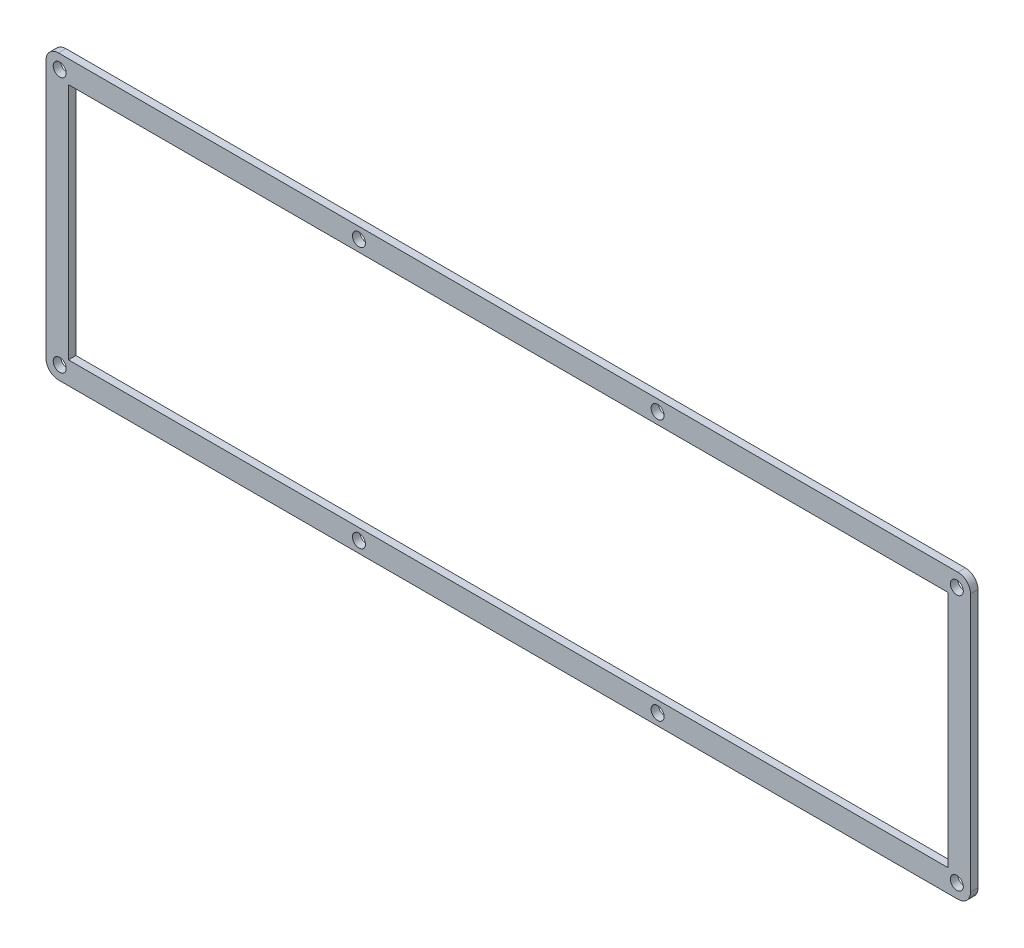
ISO-10303-21;
HEADER;
FILE_DESCRIPTION(('STEP AP214'),'2;1');
FILE_NAME('part.step','',(''),(''),'','','');
FILE_SCHEMA(('AUTOMOTIVE_DESIGN { 1 0 10303 214 1 1 1 1 }'));
ENDSEC;
DATA;
#1=APPLICATION_CONTEXT('core data for automotive mechanical design processes');
#2=APPLICATION_PROTOCOL_DEFINITION('international standard','automotive_design',2000,#1);
#3=PRODUCT_CONTEXT('',#1,'mechanical');
#4=PRODUCT('Part','Part','',(#3));
#5=PRODUCT_RELATED_PRODUCT_CATEGORY('part','',(#4));
#6=PRODUCT_DEFINITION_FORMATION('','',#4);
#7=PRODUCT_DEFINITION_CONTEXT('part definition',#1,'design');
#8=PRODUCT_DEFINITION('design','',#6,#7);
#9=PRODUCT_DEFINITION_SHAPE('','',#8);
#10=(LENGTH_UNIT() NAMED_UNIT(*) SI_UNIT(.MILLI.,.METRE.));
#11=(NAMED_UNIT(*) PLANE_ANGLE_UNIT() SI_UNIT($,.RADIAN.));
#12=(NAMED_UNIT(*) SI_UNIT($,.STERADIAN.) SOLID_ANGLE_UNIT());
#13=UNCERTAINTY_MEASURE_WITH_UNIT(LENGTH_MEASURE(1.E-05),#10,'distance_accuracy_value','');
#14=(GEOMETRIC_REPRESENTATION_CONTEXT(3) GLOBAL_UNCERTAINTY_ASSIGNED_CONTEXT((#13)) GLOBAL_UNIT_ASSIGNED_CONTEXT((#10,
#11,#12)) REPRESENTATION_CONTEXT('',''));
#15=CARTESIAN_POINT('',(0.,0.,0.));
#16=DIRECTION('',(0.,0.,1.));
#17=DIRECTION('',(1.,0.,0.));
#18=AXIS2_PLACEMENT_3D('',#15,#16,#17);
#19=CARTESIAN_POINT('',(365.774999999987,5.,3.));
#20=DIRECTION('',(0.,0.,1.));
#21=DIRECTION('',(1.,0.,0.));
#22=AXIS2_PLACEMENT_3D('',#19,#20,#21);
#23=PLANE('',#22);
#24=CARTESIAN_POINT('',(125.5,109.099999999986,3.));
#25=DIRECTION('',(0.,0.,1.));
#26=DIRECTION('',(1.,0.,0.));
#27=AXIS2_PLACEMENT_3D('',#24,#25,#26);
#28=CIRCLE('',#27,2.59999999999999);
#29=CARTESIAN_POINT('',(128.1,109.099999999986,3.));
#30=VERTEX_POINT('',#29);
#31=EDGE_CURVE('E163',#30,#30,#28,.T.);
#32=ORIENTED_EDGE('',*,*,#31,.F.);
#33=EDGE_LOOP('',(#32));
#34=FACE_BOUND('',#33,.T.);
#35=CARTESIAN_POINT('',(125.5,4.4999999999994,3.));
#36=DIRECTION('',(0.,0.,1.));
#37=DIRECTION('',(1.,0.,0.));
#38=AXIS2_PLACEMENT_3D('',#35,#36,#37);
#39=CIRCLE('',#38,2.59999999999999);
#40=CARTESIAN_POINT('',(128.1,4.4999999999994,3.));
#41=VERTEX_POINT('',#40);
#42=EDGE_CURVE('E175',#41,#41,#39,.T.);
#43=ORIENTED_EDGE('',*,*,#42,.F.);
#44=EDGE_LOOP('',(#43));
#45=FACE_BOUND('',#44,.T.);
#46=CARTESIAN_POINT('',(365.274999999985,5.49999999999991,3.));
#47=DIRECTION('',(0.,0.,1.));
#48=DIRECTION('',(1.,0.,0.));
#49=AXIS2_PLACEMENT_3D('',#46,#47,#48);
#50=CIRCLE('',#49,2.59999999999999);
#51=CARTESIAN_POINT('',(367.874999999985,5.49999999999991,3.));
#52=VERTEX_POINT('',#51);
#53=EDGE_CURVE('E187',#52,#52,#50,.T.);
#54=ORIENTED_EDGE('',*,*,#53,.F.);
#55=EDGE_LOOP('',(#54));
#56=FACE_BOUND('',#55,.T.);
#57=CARTESIAN_POINT('',(5.50000000000091,108.099999999987,3.));
#58=DIRECTION('',(0.,0.,1.));
#59=DIRECTION('',(1.,0.,0.));
#60=AXIS2_PLACEMENT_3D('',#57,#58,#59);
#61=CIRCLE('',#60,2.6);
#62=CARTESIAN_POINT('',(8.10000000000091,108.099999999987,3.));
#63=VERTEX_POINT('',#62);
#64=EDGE_CURVE('E199',#63,#63,#61,.T.);
#65=ORIENTED_EDGE('',*,*,#64,.F.);
#66=EDGE_LOOP('',(#65));
#67=FACE_BOUND('',#66,.T.);
#68=CARTESIAN_POINT('',(365.774999999987,5.,3.));
#69=DIRECTION('',(0.,0.,1.));
#70=DIRECTION('',(1.,0.,0.));
#71=AXIS2_PLACEMENT_3D('',#68,#69,#70);
#72=CIRCLE('',#71,5.);
#73=CARTESIAN_POINT('',(365.774999999987,0.,3.));
#74=VERTEX_POINT('',#73);
#75=CARTESIAN_POINT('',(370.774999999987,5.00000000000057,3.));
#76=VERTEX_POINT('',#75);
#77=EDGE_CURVE('E205',#74,#76,#72,.T.);
#78=ORIENTED_EDGE('',*,*,#77,.T.);
#79=DIRECTION('',(0.,1.,0.));
#80=VECTOR('',#79,1.);
#81=CARTESIAN_POINT('',(370.774999999987,108.6,3.));
#82=LINE('',#81,#80);
#83=CARTESIAN_POINT('',(370.774999999987,108.6,3.));
#84=VERTEX_POINT('',#83);
#85=EDGE_CURVE('E208',#76,#84,#82,.T.);
#86=ORIENTED_EDGE('',*,*,#85,.T.);
#87=CARTESIAN_POINT('',(365.774999999987,108.599999999999,3.));
#88=DIRECTION('',(0.,0.,1.));
#89=DIRECTION('',(1.,0.,0.));
#90=AXIS2_PLACEMENT_3D('',#87,#88,#89);
#91=CIRCLE('',#90,5.);
#92=CARTESIAN_POINT('',(365.774999999987,113.599999999999,3.));
#93=VERTEX_POINT('',#92);
#94=EDGE_CURVE('E211',#84,#93,#91,.T.);
#95=ORIENTED_EDGE('',*,*,#94,.T.);
#96=DIRECTION('',(-1.,0.,0.));
#97=VECTOR('',#96,1.);
#98=CARTESIAN_POINT('',(365.774999999987,113.599999999999,3.));
#99=LINE('',#98,#97);
#100=CARTESIAN_POINT('',(5.,113.599999999987,3.));
#101=VERTEX_POINT('',#100);
#102=EDGE_CURVE('E213',#93,#101,#99,.T.);
#103=ORIENTED_EDGE('',*,*,#102,.T.);
#104=CARTESIAN_POINT('',(5.,108.599999999987,3.));
#105=DIRECTION('',(0.,0.,1.));
#106=DIRECTION('',(1.,0.,0.));
#107=AXIS2_PLACEMENT_3D('',#104,#105,#106);
#108=CIRCLE('',#107,5.);
#109=CARTESIAN_POINT('',(0.,108.599999999987,3.));
#110=VERTEX_POINT('',#109);
#111=EDGE_CURVE('E215',#101,#110,#108,.T.);
#112=ORIENTED_EDGE('',*,*,#111,.T.);
#113=DIRECTION('',(0.,-1.,0.));
#114=VECTOR('',#113,1.);
#115=CARTESIAN_POINT('',(0.,108.599999999987,3.));
#116=LINE('',#115,#114);
#117=CARTESIAN_POINT('',(0.,5.0000000000006,3.));
#118=VERTEX_POINT('',#117);
#119=EDGE_CURVE('E217',#110,#118,#116,.T.);
#120=ORIENTED_EDGE('',*,*,#119,.T.);
#121=CARTESIAN_POINT('',(5.,5.0000000000006,3.));
#122=DIRECTION('',(0.,0.,1.));
#123=DIRECTION('',(1.,0.,0.));
#124=AXIS2_PLACEMENT_3D('',#121,#122,#123);
#125=CIRCLE('',#124,5.);
#126=CARTESIAN_POINT('',(5.,5.95967719618784E-13,3.));
#127=VERTEX_POINT('',#126);
#128=EDGE_CURVE('E219',#118,#127,#125,.T.);
#129=ORIENTED_EDGE('',*,*,#128,.T.);
#130=DIRECTION('',(1.,0.,0.));
#131=VECTOR('',#130,1.);
#132=CARTESIAN_POINT('',(365.774999999987,0.,3.));
#133=LINE('',#132,#131);
#134=EDGE_CURVE('E221',#127,#74,#133,.T.);
#135=ORIENTED_EDGE('',*,*,#134,.T.);
#136=EDGE_LOOP('',(#78,#86,#95,#103,#112,#120,#129,#135));
#137=FACE_BOUND('',#136,.T.);
#138=CARTESIAN_POINT('',(5.50000000000091,5.50000000000048,3.));
#139=DIRECTION('',(0.,0.,1.));
#140=DIRECTION('',(1.,0.,0.));
#141=AXIS2_PLACEMENT_3D('',#138,#139,#140);
#142=CIRCLE('',#141,2.6);
#143=CARTESIAN_POINT('',(8.10000000000091,5.50000000000048,3.));
#144=VERTEX_POINT('',#143);
#145=EDGE_CURVE('E193',#144,#144,#142,.T.);
#146=ORIENTED_EDGE('',*,*,#145,.F.);
#147=EDGE_LOOP('',(#146));
#148=FACE_BOUND('',#147,.T.);
#149=CARTESIAN_POINT('',(365.274999999985,108.1,3.));
#150=DIRECTION('',(0.,0.,1.));
#151=DIRECTION('',(1.,0.,0.));
#152=AXIS2_PLACEMENT_3D('',#149,#150,#151);
#153=CIRCLE('',#152,2.59999999999999);
#154=CARTESIAN_POINT('',(367.874999999985,108.1,3.));
#155=VERTEX_POINT('',#154);
#156=EDGE_CURVE('E181',#155,#155,#153,.T.);
#157=ORIENTED_EDGE('',*,*,#156,.F.);
#158=EDGE_LOOP('',(#157));
#159=FACE_BOUND('',#158,.T.);
#160=CARTESIAN_POINT('',(245.274999999988,4.4999999999994,3.));
#161=DIRECTION('',(0.,0.,1.));
#162=DIRECTION('',(1.,0.,0.));
#163=AXIS2_PLACEMENT_3D('',#160,#161,#162);
#164=CIRCLE('',#163,2.59999999999999);
#165=CARTESIAN_POINT('',(247.874999999988,4.4999999999994,3.));
#166=VERTEX_POINT('',#165);
#167=EDGE_CURVE('E169',#166,#166,#164,.T.);
#168=ORIENTED_EDGE('',*,*,#167,.F.);
#169=EDGE_LOOP('',(#168));
#170=FACE_BOUND('',#169,.T.);
#171=CARTESIAN_POINT('',(245.274999999988,109.099999999986,3.));
#172=DIRECTION('',(0.,0.,1.));
#173=DIRECTION('',(1.,0.,0.));
#174=AXIS2_PLACEMENT_3D('',#171,#172,#173);
#175=CIRCLE('',#174,2.59999999999999);
#176=CARTESIAN_POINT('',(247.874999999988,109.099999999986,3.));
#177=VERTEX_POINT('',#176);
#178=EDGE_CURVE('E157',#177,#177,#175,.T.);
#179=ORIENTED_EDGE('',*,*,#178,.F.);
#180=EDGE_LOOP('',(#179));
#181=FACE_BOUND('',#180,.T.);
#182=DIRECTION('',(0.,-1.,0.));
#183=VECTOR('',#182,1.);
#184=CARTESIAN_POINT('',(9.00000000000273,104.599999999987,3.));
#185=LINE('',#184,#183);
#186=CARTESIAN_POINT('',(9.00000000000273,104.599999999987,3.));
#187=VERTEX_POINT('',#186);
#188=CARTESIAN_POINT('',(9.00000000001183,9.0000000000006,3.));
#189=VERTEX_POINT('',#188);
#190=EDGE_CURVE('E129',#187,#189,#185,.T.);
#191=ORIENTED_EDGE('',*,*,#190,.F.);
#192=DIRECTION('',(-1.,0.,0.));
#193=VECTOR('',#192,1.);
#194=CARTESIAN_POINT('',(361.774999999985,104.599999999987,3.));
#195=LINE('',#194,#193);
#196=CARTESIAN_POINT('',(361.774999999985,104.599999999987,3.));
#197=VERTEX_POINT('',#196);
#198=EDGE_CURVE('E121',#197,#187,#195,.T.);
#199=ORIENTED_EDGE('',*,*,#198,.F.);
#200=DIRECTION('',(1.04518903991966E-13,1.,0.));
#201=VECTOR('',#200,1.);
#202=CARTESIAN_POINT('',(361.774999999985,104.599999999987,3.));
#203=LINE('',#202,#201);
#204=CARTESIAN_POINT('',(361.774999999975,9.00000000003962,3.));
#205=VERTEX_POINT('',#204);
#206=EDGE_CURVE('E143',#205,#197,#203,.T.);
#207=ORIENTED_EDGE('',*,*,#206,.F.);
#208=DIRECTION('',(1.,1.10616128104606E-13,0.));
#209=VECTOR('',#208,1.);
#210=CARTESIAN_POINT('',(361.774999999975,9.00000000003962,3.));
#211=LINE('',#210,#209);
#212=EDGE_CURVE('E141',#189,#205,#211,.T.);
#213=ORIENTED_EDGE('',*,*,#212,.F.);
#214=EDGE_LOOP('',(#191,#199,#207,#213));
#215=FACE_BOUND('',#214,.T.);
#216=ADVANCED_FACE('F32',(#34,#45,#56,#67,#137,#148,#159,#170,#181,#215),#23,.T.);
#217=CARTESIAN_POINT('',(365.774999999987,5.,0.));
#218=DIRECTION('',(0.,0.,1.));
#219=DIRECTION('',(1.,0.,0.));
#220=AXIS2_PLACEMENT_3D('',#217,#218,#219);
#221=PLANE('',#220);
#222=CARTESIAN_POINT('',(245.274999999988,109.099999999986,0.));
#223=DIRECTION('',(0.,0.,1.));
#224=DIRECTION('',(1.,0.,0.));
#225=AXIS2_PLACEMENT_3D('',#222,#223,#224);
#226=CIRCLE('',#225,2.59999999999999);
#227=CARTESIAN_POINT('',(247.874999999988,109.099999999986,0.));
#228=VERTEX_POINT('',#227);
#229=EDGE_CURVE('E137',#228,#228,#226,.T.);
#230=ORIENTED_EDGE('',*,*,#229,.T.);
#231=EDGE_LOOP('',(#230));
#232=FACE_BOUND('',#231,.T.);
#233=CARTESIAN_POINT('',(125.5,109.099999999986,0.));
#234=DIRECTION('',(0.,0.,1.));
#235=DIRECTION('',(1.,0.,0.));
#236=AXIS2_PLACEMENT_3D('',#233,#234,#235);
#237=CIRCLE('',#236,2.59999999999999);
#238=CARTESIAN_POINT('',(128.1,109.099999999986,0.));
#239=VERTEX_POINT('',#238);
#240=EDGE_CURVE('E160',#239,#239,#237,.T.);
#241=ORIENTED_EDGE('',*,*,#240,.T.);
#242=EDGE_LOOP('',(#241));
#243=FACE_BOUND('',#242,.T.);
#244=CARTESIAN_POINT('',(245.274999999988,4.4999999999994,0.));
#245=DIRECTION('',(0.,0.,1.));
#246=DIRECTION('',(1.,0.,0.));
#247=AXIS2_PLACEMENT_3D('',#244,#245,#246);
#248=CIRCLE('',#247,2.59999999999999);
#249=CARTESIAN_POINT('',(247.874999999988,4.4999999999994,0.));
#250=VERTEX_POINT('',#249);
#251=EDGE_CURVE('E166',#250,#250,#248,.T.);
#252=ORIENTED_EDGE('',*,*,#251,.T.);
#253=EDGE_LOOP('',(#252));
#254=FACE_BOUND('',#253,.T.);
#255=CARTESIAN_POINT('',(125.5,4.4999999999994,0.));
#256=DIRECTION('',(0.,0.,1.));
#257=DIRECTION('',(1.,0.,0.));
#258=AXIS2_PLACEMENT_3D('',#255,#256,#257);
#259=CIRCLE('',#258,2.59999999999999);
#260=CARTESIAN_POINT('',(128.1,4.4999999999994,0.));
#261=VERTEX_POINT('',#260);
#262=EDGE_CURVE('E172',#261,#261,#259,.T.);
#263=ORIENTED_EDGE('',*,*,#262,.T.);
#264=EDGE_LOOP('',(#263));
#265=FACE_BOUND('',#264,.T.);
#266=CARTESIAN_POINT('',(365.274999999985,108.1,0.));
#267=DIRECTION('',(0.,0.,1.));
#268=DIRECTION('',(1.,0.,0.));
#269=AXIS2_PLACEMENT_3D('',#266,#267,#268);
#270=CIRCLE('',#269,2.59999999999999);
#271=CARTESIAN_POINT('',(367.874999999985,108.1,0.));
#272=VERTEX_POINT('',#271);
#273=EDGE_CURVE('E178',#272,#272,#270,.T.);
#274=ORIENTED_EDGE('',*,*,#273,.T.);
#275=EDGE_LOOP('',(#274));
#276=FACE_BOUND('',#275,.T.);
#277=CARTESIAN_POINT('',(365.274999999985,5.49999999999991,0.));
#278=DIRECTION('',(0.,0.,1.));
#279=DIRECTION('',(1.,0.,0.));
#280=AXIS2_PLACEMENT_3D('',#277,#278,#279);
#281=CIRCLE('',#280,2.59999999999999);
#282=CARTESIAN_POINT('',(367.874999999985,5.49999999999991,0.));
#283=VERTEX_POINT('',#282);
#284=EDGE_CURVE('E184',#283,#283,#281,.T.);
#285=ORIENTED_EDGE('',*,*,#284,.T.);
#286=EDGE_LOOP('',(#285));
#287=FACE_BOUND('',#286,.T.);
#288=CARTESIAN_POINT('',(5.50000000000091,5.50000000000048,0.));
#289=DIRECTION('',(0.,0.,1.));
#290=DIRECTION('',(1.,0.,0.));
#291=AXIS2_PLACEMENT_3D('',#288,#289,#290);
#292=CIRCLE('',#291,2.6);
#293=CARTESIAN_POINT('',(8.10000000000091,5.50000000000048,0.));
#294=VERTEX_POINT('',#293);
#295=EDGE_CURVE('E190',#294,#294,#292,.T.);
#296=ORIENTED_EDGE('',*,*,#295,.T.);
#297=EDGE_LOOP('',(#296));
#298=FACE_BOUND('',#297,.T.);
#299=CARTESIAN_POINT('',(5.50000000000091,108.099999999987,0.));
#300=DIRECTION('',(0.,0.,1.));
#301=DIRECTION('',(1.,0.,0.));
#302=AXIS2_PLACEMENT_3D('',#299,#300,#301);
#303=CIRCLE('',#302,2.6);
#304=CARTESIAN_POINT('',(8.10000000000091,108.099999999987,0.));
#305=VERTEX_POINT('',#304);
#306=EDGE_CURVE('E196',#305,#305,#303,.T.);
#307=ORIENTED_EDGE('',*,*,#306,.T.);
#308=EDGE_LOOP('',(#307));
#309=FACE_BOUND('',#308,.T.);
#310=CARTESIAN_POINT('',(365.774999999987,5.,0.));
#311=DIRECTION('',(0.,0.,1.));
#312=DIRECTION('',(1.,0.,0.));
#313=AXIS2_PLACEMENT_3D('',#310,#311,#312);
#314=CIRCLE('',#313,5.);
#315=CARTESIAN_POINT('',(365.774999999987,0.,0.));
#316=VERTEX_POINT('',#315);
#317=CARTESIAN_POINT('',(370.774999999987,5.00000000000057,0.));
#318=VERTEX_POINT('',#317);
#319=EDGE_CURVE('E202',#316,#318,#314,.T.);
#320=ORIENTED_EDGE('',*,*,#319,.F.);
#321=DIRECTION('',(1.,0.,0.));
#322=VECTOR('',#321,1.);
#323=CARTESIAN_POINT('',(365.774999999987,0.,0.));
#324=LINE('',#323,#322);
#325=CARTESIAN_POINT('',(5.,5.95967719618784E-13,0.));
#326=VERTEX_POINT('',#325);
#327=EDGE_CURVE('E209',#326,#316,#324,.T.);
#328=ORIENTED_EDGE('',*,*,#327,.F.);
#329=CARTESIAN_POINT('',(5.,5.0000000000006,0.));
#330=DIRECTION('',(0.,0.,1.));
#331=DIRECTION('',(1.,0.,0.));
#332=AXIS2_PLACEMENT_3D('',#329,#330,#331);
#333=CIRCLE('',#332,5.);
#334=CARTESIAN_POINT('',(0.,5.0000000000006,0.));
#335=VERTEX_POINT('',#334);
#336=EDGE_CURVE('E236',#335,#326,#333,.T.);
#337=ORIENTED_EDGE('',*,*,#336,.F.);
#338=DIRECTION('',(0.,-1.,0.));
#339=VECTOR('',#338,1.);
#340=CARTESIAN_POINT('',(0.,108.599999999987,0.));
#341=LINE('',#340,#339);
#342=CARTESIAN_POINT('',(0.,108.599999999987,0.));
#343=VERTEX_POINT('',#342);
#344=EDGE_CURVE('E234',#343,#335,#341,.T.);
#345=ORIENTED_EDGE('',*,*,#344,.F.);
#346=CARTESIAN_POINT('',(5.,108.599999999987,0.));
#347=DIRECTION('',(0.,0.,1.));
#348=DIRECTION('',(1.,0.,0.));
#349=AXIS2_PLACEMENT_3D('',#346,#347,#348);
#350=CIRCLE('',#349,5.);
#351=CARTESIAN_POINT('',(5.,113.599999999987,0.));
#352=VERTEX_POINT('',#351);
#353=EDGE_CURVE('E232',#352,#343,#350,.T.);
#354=ORIENTED_EDGE('',*,*,#353,.F.);
#355=DIRECTION('',(-1.,0.,0.));
#356=VECTOR('',#355,1.);
#357=CARTESIAN_POINT('',(365.774999999987,113.599999999999,0.));
#358=LINE('',#357,#356);
#359=CARTESIAN_POINT('',(365.774999999987,113.599999999999,0.));
#360=VERTEX_POINT('',#359);
#361=EDGE_CURVE('E230',#360,#352,#358,.T.);
#362=ORIENTED_EDGE('',*,*,#361,.F.);
#363=CARTESIAN_POINT('',(365.774999999987,108.599999999999,0.));
#364=DIRECTION('',(0.,0.,1.));
#365=DIRECTION('',(1.,0.,0.));
#366=AXIS2_PLACEMENT_3D('',#363,#364,#365);
#367=CIRCLE('',#366,5.);
#368=CARTESIAN_POINT('',(370.774999999987,108.6,0.));
#369=VERTEX_POINT('',#368);
#370=EDGE_CURVE('E228',#369,#360,#367,.T.);
#371=ORIENTED_EDGE('',*,*,#370,.F.);
#372=DIRECTION('',(0.,1.,0.));
#373=VECTOR('',#372,1.);
#374=CARTESIAN_POINT('',(370.774999999987,108.6,0.));
#375=LINE('',#374,#373);
#376=EDGE_CURVE('E226',#318,#369,#375,.T.);
#377=ORIENTED_EDGE('',*,*,#376,.F.);
#378=EDGE_LOOP('',(#320,#328,#337,#345,#354,#362,#371,#377));
#379=FACE_BOUND('',#378,.T.);
#380=DIRECTION('',(-1.,0.,0.));
#381=VECTOR('',#380,1.);
#382=CARTESIAN_POINT('',(361.774999999985,104.599999999987,0.));
#383=LINE('',#382,#381);
#384=CARTESIAN_POINT('',(361.774999999985,104.599999999987,0.));
#385=VERTEX_POINT('',#384);
#386=CARTESIAN_POINT('',(9.00000000000273,104.599999999987,0.));
#387=VERTEX_POINT('',#386);
#388=EDGE_CURVE('E55',#385,#387,#383,.T.);
#389=ORIENTED_EDGE('',*,*,#388,.T.);
#390=DIRECTION('',(0.,-1.,0.));
#391=VECTOR('',#390,1.);
#392=CARTESIAN_POINT('',(9.00000000000273,104.599999999987,0.));
#393=LINE('',#392,#391);
#394=CARTESIAN_POINT('',(9.00000000001183,9.0000000000006,0.));
#395=VERTEX_POINT('',#394);
#396=EDGE_CURVE('E136',#387,#395,#393,.T.);
#397=ORIENTED_EDGE('',*,*,#396,.T.);
#398=DIRECTION('',(1.,1.10616128104606E-13,0.));
#399=VECTOR('',#398,1.);
#400=CARTESIAN_POINT('',(361.774999999975,9.00000000003962,0.));
#401=LINE('',#400,#399);
#402=CARTESIAN_POINT('',(361.774999999975,9.00000000003962,0.));
#403=VERTEX_POINT('',#402);
#404=EDGE_CURVE('E149',#395,#403,#401,.T.);
#405=ORIENTED_EDGE('',*,*,#404,.T.);
#406=DIRECTION('',(1.04518903991966E-13,1.,0.));
#407=VECTOR('',#406,1.);
#408=CARTESIAN_POINT('',(361.774999999985,104.599999999987,0.));
#409=LINE('',#408,#407);
#410=EDGE_CURVE('E130',#403,#385,#409,.T.);
#411=ORIENTED_EDGE('',*,*,#410,.T.);
#412=EDGE_LOOP('',(#389,#397,#405,#411));
#413=FACE_BOUND('',#412,.T.);
#414=ADVANCED_FACE('F266',(#232,#243,#254,#265,#276,#287,#298,#309,#379,#413),#221,.F.);
#415=CARTESIAN_POINT('',(365.774999999987,5.,3.));
#416=DIRECTION('',(0.,0.,-1.));
#417=DIRECTION('',(-1.,0.,0.));
#418=AXIS2_PLACEMENT_3D('',#415,#416,#417);
#419=CYLINDRICAL_SURFACE('',#418,5.);
#420=ORIENTED_EDGE('',*,*,#319,.T.);
#421=DIRECTION('',(0.,0.,-1.));
#422=VECTOR('',#421,1.);
#423=CARTESIAN_POINT('',(370.774999999987,5.00000000000057,3.));
#424=LINE('',#423,#422);
#425=EDGE_CURVE('E11',#76,#318,#424,.T.);
#426=ORIENTED_EDGE('',*,*,#425,.F.);
#427=ORIENTED_EDGE('',*,*,#77,.F.);
#428=DIRECTION('',(0.,0.,-1.));
#429=VECTOR('',#428,1.);
#430=CARTESIAN_POINT('',(365.774999999987,0.,3.));
#431=LINE('',#430,#429);
#432=EDGE_CURVE('E223',#74,#316,#431,.T.);
#433=ORIENTED_EDGE('',*,*,#432,.T.);
#434=EDGE_LOOP('',(#420,#426,#427,#433));
#435=FACE_BOUND('',#434,.T.);
#436=ADVANCED_FACE('F34',(#435),#419,.T.);
#437=CARTESIAN_POINT('',(370.774999999987,108.6,3.));
#438=DIRECTION('',(-1.,0.,0.));
#439=DIRECTION('',(0.,0.,1.));
#440=AXIS2_PLACEMENT_3D('',#437,#438,#439);
#441=PLANE('',#440);
#442=ORIENTED_EDGE('',*,*,#376,.T.);
#443=DIRECTION('',(0.,0.,-1.));
#444=VECTOR('',#443,1.);
#445=CARTESIAN_POINT('',(370.774999999987,108.6,3.));
#446=LINE('',#445,#444);
#447=EDGE_CURVE('E40',#84,#369,#446,.T.);
#448=ORIENTED_EDGE('',*,*,#447,.F.);
#449=ORIENTED_EDGE('',*,*,#85,.F.);
#450=ORIENTED_EDGE('',*,*,#425,.T.);
#451=EDGE_LOOP('',(#442,#448,#449,#450));
#452=FACE_BOUND('',#451,.T.);
#453=ADVANCED_FACE('F284',(#452),#441,.F.);
#454=CARTESIAN_POINT('',(365.774999999987,108.599999999999,3.));
#455=DIRECTION('',(0.,0.,-1.));
#456=DIRECTION('',(-1.,0.,0.));
#457=AXIS2_PLACEMENT_3D('',#454,#455,#456);
#458=CYLINDRICAL_SURFACE('',#457,5.);
#459=ORIENTED_EDGE('',*,*,#370,.T.);
#460=DIRECTION('',(0.,0.,-1.));
#461=VECTOR('',#460,1.);
#462=CARTESIAN_POINT('',(365.774999999987,113.599999999999,3.));
#463=LINE('',#462,#461);
#464=EDGE_CURVE('E253',#93,#360,#463,.T.);
#465=ORIENTED_EDGE('',*,*,#464,.F.);
#466=ORIENTED_EDGE('',*,*,#94,.F.);
#467=ORIENTED_EDGE('',*,*,#447,.T.);
#468=EDGE_LOOP('',(#459,#465,#466,#467));
#469=FACE_BOUND('',#468,.T.);
#470=ADVANCED_FACE('F260',(#469),#458,.T.);
#471=CARTESIAN_POINT('',(365.774999999987,113.599999999999,3.));
#472=DIRECTION('',(0.,-1.,0.));
#473=DIRECTION('',(1.,0.,0.));
#474=AXIS2_PLACEMENT_3D('',#471,#472,#473);
#475=PLANE('',#474);
#476=ORIENTED_EDGE('',*,*,#361,.T.);
#477=DIRECTION('',(0.,0.,-1.));
#478=VECTOR('',#477,1.);
#479=CARTESIAN_POINT('',(5.,113.599999999987,3.));
#480=LINE('',#479,#478);
#481=EDGE_CURVE('E250',#101,#352,#480,.T.);
#482=ORIENTED_EDGE('',*,*,#481,.F.);
#483=ORIENTED_EDGE('',*,*,#102,.F.);
#484=ORIENTED_EDGE('',*,*,#464,.T.);
#485=EDGE_LOOP('',(#476,#482,#483,#484));
#486=FACE_BOUND('',#485,.T.);
#487=ADVANCED_FACE('F272',(#486),#475,.F.);
#488=CARTESIAN_POINT('',(5.,108.599999999987,3.));
#489=DIRECTION('',(0.,0.,-1.));
#490=DIRECTION('',(-1.,0.,0.));
#491=AXIS2_PLACEMENT_3D('',#488,#489,#490);
#492=CYLINDRICAL_SURFACE('',#491,5.);
#493=ORIENTED_EDGE('',*,*,#353,.T.);
#494=DIRECTION('',(0.,0.,-1.));
#495=VECTOR('',#494,1.);
#496=CARTESIAN_POINT('',(0.,108.599999999987,3.));
#497=LINE('',#496,#495);
#498=EDGE_CURVE('E247',#110,#343,#497,.T.);
#499=ORIENTED_EDGE('',*,*,#498,.F.);
#500=ORIENTED_EDGE('',*,*,#111,.F.);
#501=ORIENTED_EDGE('',*,*,#481,.T.);
#502=EDGE_LOOP('',(#493,#499,#500,#501));
#503=FACE_BOUND('',#502,.T.);
#504=ADVANCED_FACE('F276',(#503),#492,.T.);
#505=CARTESIAN_POINT('',(0.,108.599999999987,3.));
#506=DIRECTION('',(1.,0.,0.));
#507=DIRECTION('',(0.,0.,-1.));
#508=AXIS2_PLACEMENT_3D('',#505,#506,#507);
#509=PLANE('',#508);
#510=ORIENTED_EDGE('',*,*,#344,.T.);
#511=DIRECTION('',(0.,0.,-1.));
#512=VECTOR('',#511,1.);
#513=CARTESIAN_POINT('',(0.,5.0000000000006,3.));
#514=LINE('',#513,#512);
#515=EDGE_CURVE('E244',#118,#335,#514,.T.);
#516=ORIENTED_EDGE('',*,*,#515,.F.);
#517=ORIENTED_EDGE('',*,*,#119,.F.);
#518=ORIENTED_EDGE('',*,*,#498,.T.);
#519=EDGE_LOOP('',(#510,#516,#517,#518));
#520=FACE_BOUND('',#519,.T.);
#521=ADVANCED_FACE('F297',(#520),#509,.F.);
#522=CARTESIAN_POINT('',(5.,5.0000000000006,3.));
#523=DIRECTION('',(0.,0.,-1.));
#524=DIRECTION('',(-1.,0.,0.));
#525=AXIS2_PLACEMENT_3D('',#522,#523,#524);
#526=CYLINDRICAL_SURFACE('',#525,5.);
#527=ORIENTED_EDGE('',*,*,#336,.T.);
#528=DIRECTION('',(0.,0.,-1.));
#529=VECTOR('',#528,1.);
#530=CARTESIAN_POINT('',(5.,5.95967719618784E-13,3.));
#531=LINE('',#530,#529);
#532=EDGE_CURVE('E241',#127,#326,#531,.T.);
#533=ORIENTED_EDGE('',*,*,#532,.F.);
#534=ORIENTED_EDGE('',*,*,#128,.F.);
#535=ORIENTED_EDGE('',*,*,#515,.T.);
#536=EDGE_LOOP('',(#527,#533,#534,#535));
#537=FACE_BOUND('',#536,.T.);
#538=ADVANCED_FACE('F295',(#537),#526,.T.);
#539=CARTESIAN_POINT('',(365.774999999987,0.,3.));
#540=DIRECTION('',(0.,1.,0.));
#541=DIRECTION('',(-1.,0.,0.));
#542=AXIS2_PLACEMENT_3D('',#539,#540,#541);
#543=PLANE('',#542);
#544=ORIENTED_EDGE('',*,*,#327,.T.);
#545=ORIENTED_EDGE('',*,*,#432,.F.);
#546=ORIENTED_EDGE('',*,*,#134,.F.);
#547=ORIENTED_EDGE('',*,*,#532,.T.);
#548=EDGE_LOOP('',(#544,#545,#546,#547));
#549=FACE_BOUND('',#548,.T.);
#550=ADVANCED_FACE('F290',(#549),#543,.F.);
#551=CARTESIAN_POINT('',(5.50000000000091,108.099999999987,3.));
#552=DIRECTION('',(0.,0.,-1.));
#553=DIRECTION('',(-1.,0.,0.));
#554=AXIS2_PLACEMENT_3D('',#551,#552,#553);
#555=CYLINDRICAL_SURFACE('',#554,2.6);
#556=ORIENTED_EDGE('',*,*,#64,.T.);
#557=EDGE_LOOP('',(#556));
#558=FACE_BOUND('',#557,.T.);
#559=ORIENTED_EDGE('',*,*,#306,.F.);
#560=EDGE_LOOP('',(#559));
#561=FACE_BOUND('',#560,.T.);
#562=ADVANCED_FACE('F317',(#558,#561),#555,.F.);
#563=CARTESIAN_POINT('',(5.50000000000091,5.50000000000048,3.));
#564=DIRECTION('',(0.,0.,-1.));
#565=DIRECTION('',(-1.,0.,0.));
#566=AXIS2_PLACEMENT_3D('',#563,#564,#565);
#567=CYLINDRICAL_SURFACE('',#566,2.6);
#568=ORIENTED_EDGE('',*,*,#145,.T.);
#569=EDGE_LOOP('',(#568));
#570=FACE_BOUND('',#569,.T.);
#571=ORIENTED_EDGE('',*,*,#295,.F.);
#572=EDGE_LOOP('',(#571));
#573=FACE_BOUND('',#572,.T.);
#574=ADVANCED_FACE('F324',(#570,#573),#567,.F.);
#575=CARTESIAN_POINT('',(365.274999999985,5.49999999999991,3.));
#576=DIRECTION('',(0.,0.,-1.));
#577=DIRECTION('',(-1.,0.,0.));
#578=AXIS2_PLACEMENT_3D('',#575,#576,#577);
#579=CYLINDRICAL_SURFACE('',#578,2.59999999999999);
#580=ORIENTED_EDGE('',*,*,#53,.T.);
#581=EDGE_LOOP('',(#580));
#582=FACE_BOUND('',#581,.T.);
#583=ORIENTED_EDGE('',*,*,#284,.F.);
#584=EDGE_LOOP('',(#583));
#585=FACE_BOUND('',#584,.T.);
#586=ADVANCED_FACE('F329',(#582,#585),#579,.F.);
#587=CARTESIAN_POINT('',(365.274999999985,108.1,3.));
#588=DIRECTION('',(0.,0.,-1.));
#589=DIRECTION('',(-1.,0.,0.));
#590=AXIS2_PLACEMENT_3D('',#587,#588,#589);
#591=CYLINDRICAL_SURFACE('',#590,2.59999999999999);
#592=ORIENTED_EDGE('',*,*,#156,.T.);
#593=EDGE_LOOP('',(#592));
#594=FACE_BOUND('',#593,.T.);
#595=ORIENTED_EDGE('',*,*,#273,.F.);
#596=EDGE_LOOP('',(#595));
#597=FACE_BOUND('',#596,.T.);
#598=ADVANCED_FACE('F339',(#594,#597),#591,.F.);
#599=CARTESIAN_POINT('',(125.5,4.4999999999994,3.));
#600=DIRECTION('',(0.,0.,-1.));
#601=DIRECTION('',(-1.,0.,0.));
#602=AXIS2_PLACEMENT_3D('',#599,#600,#601);
#603=CYLINDRICAL_SURFACE('',#602,2.59999999999999);
#604=ORIENTED_EDGE('',*,*,#42,.T.);
#605=EDGE_LOOP('',(#604));
#606=FACE_BOUND('',#605,.T.);
#607=ORIENTED_EDGE('',*,*,#262,.F.);
#608=EDGE_LOOP('',(#607));
#609=FACE_BOUND('',#608,.T.);
#610=ADVANCED_FACE('F346',(#606,#609),#603,.F.);
#611=CARTESIAN_POINT('',(245.274999999988,4.4999999999994,3.));
#612=DIRECTION('',(0.,0.,-1.));
#613=DIRECTION('',(-1.,0.,0.));
#614=AXIS2_PLACEMENT_3D('',#611,#612,#613);
#615=CYLINDRICAL_SURFACE('',#614,2.59999999999999);
#616=ORIENTED_EDGE('',*,*,#167,.T.);
#617=EDGE_LOOP('',(#616));
#618=FACE_BOUND('',#617,.T.);
#619=ORIENTED_EDGE('',*,*,#251,.F.);
#620=EDGE_LOOP('',(#619));
#621=FACE_BOUND('',#620,.T.);
#622=ADVANCED_FACE('F350',(#618,#621),#615,.F.);
#623=CARTESIAN_POINT('',(125.5,109.099999999986,3.));
#624=DIRECTION('',(0.,0.,-1.));
#625=DIRECTION('',(-1.,0.,0.));
#626=AXIS2_PLACEMENT_3D('',#623,#624,#625);
#627=CYLINDRICAL_SURFACE('',#626,2.59999999999999);
#628=ORIENTED_EDGE('',*,*,#31,.T.);
#629=EDGE_LOOP('',(#628));
#630=FACE_BOUND('',#629,.T.);
#631=ORIENTED_EDGE('',*,*,#240,.F.);
#632=EDGE_LOOP('',(#631));
#633=FACE_BOUND('',#632,.T.);
#634=ADVANCED_FACE('F354',(#630,#633),#627,.F.);
#635=CARTESIAN_POINT('',(245.274999999988,109.099999999986,3.));
#636=DIRECTION('',(0.,0.,-1.));
#637=DIRECTION('',(-1.,0.,0.));
#638=AXIS2_PLACEMENT_3D('',#635,#636,#637);
#639=CYLINDRICAL_SURFACE('',#638,2.59999999999999);
#640=ORIENTED_EDGE('',*,*,#178,.T.);
#641=EDGE_LOOP('',(#640));
#642=FACE_BOUND('',#641,.T.);
#643=ORIENTED_EDGE('',*,*,#229,.F.);
#644=EDGE_LOOP('',(#643));
#645=FACE_BOUND('',#644,.T.);
#646=ADVANCED_FACE('F358',(#642,#645),#639,.F.);
#647=CARTESIAN_POINT('',(361.774999999985,104.599999999987,3.));
#648=DIRECTION('',(0.,-1.,0.));
#649=DIRECTION('',(0.,0.,-1.));
#650=AXIS2_PLACEMENT_3D('',#647,#648,#649);
#651=PLANE('',#650);
#652=ORIENTED_EDGE('',*,*,#388,.F.);
#653=DIRECTION('',(0.,0.,-1.));
#654=VECTOR('',#653,1.);
#655=CARTESIAN_POINT('',(361.774999999985,104.599999999987,3.));
#656=LINE('',#655,#654);
#657=EDGE_CURVE('E125',#197,#385,#656,.T.);
#658=ORIENTED_EDGE('',*,*,#657,.F.);
#659=ORIENTED_EDGE('',*,*,#198,.T.);
#660=DIRECTION('',(0.,0.,-1.));
#661=VECTOR('',#660,1.);
#662=CARTESIAN_POINT('',(9.00000000000273,104.599999999987,3.));
#663=LINE('',#662,#661);
#664=EDGE_CURVE('E124',#187,#387,#663,.T.);
#665=ORIENTED_EDGE('',*,*,#664,.T.);
#666=EDGE_LOOP('',(#652,#658,#659,#665));
#667=FACE_BOUND('',#666,.T.);
#668=ADVANCED_FACE('F123',(#667),#651,.T.);
#669=CARTESIAN_POINT('',(9.00000000000273,104.599999999987,3.));
#670=DIRECTION('',(1.,0.,0.));
#671=DIRECTION('',(0.,1.,0.));
#672=AXIS2_PLACEMENT_3D('',#669,#670,#671);
#673=PLANE('',#672);
#674=ORIENTED_EDGE('',*,*,#396,.F.);
#675=ORIENTED_EDGE('',*,*,#664,.F.);
#676=ORIENTED_EDGE('',*,*,#190,.T.);
#677=DIRECTION('',(0.,0.,-1.));
#678=VECTOR('',#677,1.);
#679=CARTESIAN_POINT('',(9.00000000001183,9.0000000000006,3.));
#680=LINE('',#679,#678);
#681=EDGE_CURVE('E138',#189,#395,#680,.T.);
#682=ORIENTED_EDGE('',*,*,#681,.T.);
#683=EDGE_LOOP('',(#674,#675,#676,#682));
#684=FACE_BOUND('',#683,.T.);
#685=ADVANCED_FACE('F133',(#684),#673,.T.);
#686=CARTESIAN_POINT('',(361.774999999975,9.00000000003962,3.));
#687=DIRECTION('',(-1.10616128104606E-13,1.,0.));
#688=DIRECTION('',(-1.,-1.10616128104606E-13,0.));
#689=AXIS2_PLACEMENT_3D('',#686,#687,#688);
#690=PLANE('',#689);
#691=ORIENTED_EDGE('',*,*,#404,.F.);
#692=ORIENTED_EDGE('',*,*,#681,.F.);
#693=ORIENTED_EDGE('',*,*,#212,.T.);
#694=DIRECTION('',(0.,0.,-1.));
#695=VECTOR('',#694,1.);
#696=CARTESIAN_POINT('',(361.774999999975,9.00000000003962,3.));
#697=LINE('',#696,#695);
#698=EDGE_CURVE('E47',#205,#403,#697,.T.);
#699=ORIENTED_EDGE('',*,*,#698,.T.);
#700=EDGE_LOOP('',(#691,#692,#693,#699));
#701=FACE_BOUND('',#700,.T.);
#702=ADVANCED_FACE('F367',(#701),#690,.T.);
#703=CARTESIAN_POINT('',(361.774999999985,104.599999999987,3.));
#704=DIRECTION('',(-1.,1.04518903991966E-13,0.));
#705=DIRECTION('',(-1.04518903991966E-13,-1.,0.));
#706=AXIS2_PLACEMENT_3D('',#703,#704,#705);
#707=PLANE('',#706);
#708=ORIENTED_EDGE('',*,*,#410,.F.);
#709=ORIENTED_EDGE('',*,*,#698,.F.);
#710=ORIENTED_EDGE('',*,*,#206,.T.);
#711=ORIENTED_EDGE('',*,*,#657,.T.);
#712=EDGE_LOOP('',(#708,#709,#710,#711));
#713=FACE_BOUND('',#712,.T.);
#714=ADVANCED_FACE('F370',(#713),#707,.T.);
#715=CLOSED_SHELL('',(#216,#414,#436,#453,#470,#487,#504,#521,#538,#550,#562,#574,#586,#598,
#610,#622,#634,#646,#668,#685,#702,#714));
#716=MANIFOLD_SOLID_BREP('B2',#715);
#717=ADVANCED_BREP_SHAPE_REPRESENTATION('',(#18,#716),#14);
#718=SHAPE_DEFINITION_REPRESENTATION(#9,#717);
ENDSEC;
END-ISO-10303-21;
